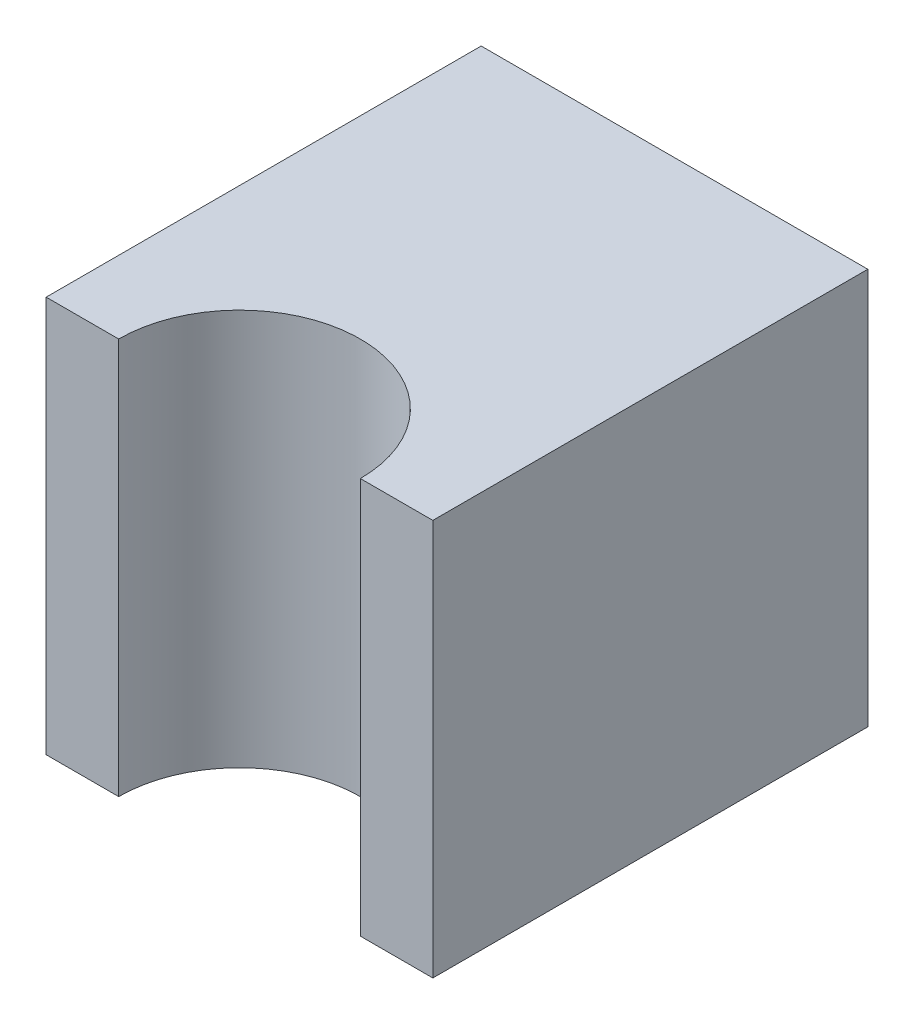
ISO-10303-21;
HEADER;
FILE_DESCRIPTION(('STEP AP214'),'2;1');
FILE_NAME('part.step','',(''),(''),'','','');
FILE_SCHEMA(('AUTOMOTIVE_DESIGN { 1 0 10303 214 1 1 1 1 }'));
ENDSEC;
DATA;
#1=APPLICATION_CONTEXT('core data for automotive mechanical design processes');
#2=APPLICATION_PROTOCOL_DEFINITION('international standard','automotive_design',2000,#1);
#3=PRODUCT_CONTEXT('',#1,'mechanical');
#4=PRODUCT('Part','Part','',(#3));
#5=PRODUCT_RELATED_PRODUCT_CATEGORY('part','',(#4));
#6=PRODUCT_DEFINITION_FORMATION('','',#4);
#7=PRODUCT_DEFINITION_CONTEXT('part definition',#1,'design');
#8=PRODUCT_DEFINITION('design','',#6,#7);
#9=PRODUCT_DEFINITION_SHAPE('','',#8);
#10=(LENGTH_UNIT() NAMED_UNIT(*) SI_UNIT(.MILLI.,.METRE.));
#11=(NAMED_UNIT(*) PLANE_ANGLE_UNIT() SI_UNIT($,.RADIAN.));
#12=(NAMED_UNIT(*) SI_UNIT($,.STERADIAN.) SOLID_ANGLE_UNIT());
#13=UNCERTAINTY_MEASURE_WITH_UNIT(LENGTH_MEASURE(1.E-05),#10,'distance_accuracy_value','');
#14=(GEOMETRIC_REPRESENTATION_CONTEXT(3) GLOBAL_UNCERTAINTY_ASSIGNED_CONTEXT((#13)) GLOBAL_UNIT_ASSIGNED_CONTEXT((#10,
#11,#12)) REPRESENTATION_CONTEXT('',''));
#15=CARTESIAN_POINT('',(0.,0.,0.));
#16=DIRECTION('',(0.,0.,1.));
#17=DIRECTION('',(1.,0.,0.));
#18=AXIS2_PLACEMENT_3D('',#15,#16,#17);
#19=CARTESIAN_POINT('',(0.65,0.,6.1));
#20=DIRECTION('',(0.,0.,1.));
#21=DIRECTION('',(1.,0.,0.));
#22=AXIS2_PLACEMENT_3D('',#19,#20,#21);
#23=PLANE('',#22);
#24=DIRECTION('',(1.,0.,0.));
#25=VECTOR('',#24,1.);
#26=CARTESIAN_POINT('',(0.4,0.82,6.1));
#27=LINE('',#26,#25);
#28=CARTESIAN_POINT('',(0.65,0.82,6.1));
#29=VERTEX_POINT('',#28);
#30=CARTESIAN_POINT('',(0.8,0.82,6.1));
#31=VERTEX_POINT('',#30);
#32=EDGE_CURVE('E76',#29,#31,#27,.T.);
#33=ORIENTED_EDGE('',*,*,#32,.F.);
#34=DIRECTION('',(0.,1.,0.));
#35=VECTOR('',#34,1.);
#36=CARTESIAN_POINT('',(0.65,0.,6.1));
#37=LINE('',#36,#35);
#38=CARTESIAN_POINT('',(0.65,0.,6.1));
#39=VERTEX_POINT('',#38);
#40=EDGE_CURVE('E72',#29,#39,#37,.F.);
#41=ORIENTED_EDGE('',*,*,#40,.T.);
#42=DIRECTION('',(1.,0.,0.));
#43=VECTOR('',#42,1.);
#44=CARTESIAN_POINT('',(0.4,0.,6.1));
#45=LINE('',#44,#43);
#46=CARTESIAN_POINT('',(0.8,0.,6.1));
#47=VERTEX_POINT('',#46);
#48=EDGE_CURVE('E73',#39,#47,#45,.T.);
#49=ORIENTED_EDGE('',*,*,#48,.T.);
#50=DIRECTION('',(0.,1.,0.));
#51=VECTOR('',#50,1.);
#52=CARTESIAN_POINT('',(0.8,0.,6.1));
#53=LINE('',#52,#51);
#54=EDGE_CURVE('E80',#31,#47,#53,.F.);
#55=ORIENTED_EDGE('',*,*,#54,.F.);
#56=EDGE_LOOP('',(#33,#41,#49,#55));
#57=FACE_BOUND('',#56,.T.);
#58=ADVANCED_FACE('F17',(#57),#23,.T.);
#59=CARTESIAN_POINT('',(0.4,0.,6.1));
#60=DIRECTION('',(0.,1.,0.));
#61=DIRECTION('',(0.,0.,1.));
#62=AXIS2_PLACEMENT_3D('',#59,#60,#61);
#63=CYLINDRICAL_SURFACE('',#62,0.25);
#64=ORIENTED_EDGE('',*,*,#40,.F.);
#65=CARTESIAN_POINT('',(0.4,0.82,6.1));
#66=DIRECTION('',(0.,1.,0.));
#67=DIRECTION('',(0.,0.,1.));
#68=AXIS2_PLACEMENT_3D('',#65,#66,#67);
#69=CIRCLE('',#68,0.25);
#70=CARTESIAN_POINT('',(0.15,0.82,6.1));
#71=VERTEX_POINT('',#70);
#72=EDGE_CURVE('E129',#71,#29,#69,.F.);
#73=ORIENTED_EDGE('',*,*,#72,.F.);
#74=DIRECTION('',(0.,1.,0.));
#75=VECTOR('',#74,1.);
#76=CARTESIAN_POINT('',(0.15,0.,6.1));
#77=LINE('',#76,#75);
#78=CARTESIAN_POINT('',(0.15,0.,6.1));
#79=VERTEX_POINT('',#78);
#80=EDGE_CURVE('E83',#79,#71,#77,.T.);
#81=ORIENTED_EDGE('',*,*,#80,.F.);
#82=CARTESIAN_POINT('',(0.4,0.,6.1));
#83=DIRECTION('',(0.,1.,0.));
#84=DIRECTION('',(0.,0.,1.));
#85=AXIS2_PLACEMENT_3D('',#82,#83,#84);
#86=CIRCLE('',#85,0.25);
#87=EDGE_CURVE('E20',#79,#39,#86,.F.);
#88=ORIENTED_EDGE('',*,*,#87,.T.);
#89=EDGE_LOOP('',(#64,#73,#81,#88));
#90=FACE_BOUND('',#89,.T.);
#91=ADVANCED_FACE('F82',(#90),#63,.F.);
#92=CARTESIAN_POINT('',(0.8,0.,6.1));
#93=DIRECTION('',(1.,0.,0.));
#94=DIRECTION('',(0.,0.,-1.));
#95=AXIS2_PLACEMENT_3D('',#92,#93,#94);
#96=PLANE('',#95);
#97=DIRECTION('',(0.,0.,1.));
#98=VECTOR('',#97,1.);
#99=CARTESIAN_POINT('',(0.8,0.82,5.65));
#100=LINE('',#99,#98);
#101=CARTESIAN_POINT('',(0.8,0.82,5.2));
#102=VERTEX_POINT('',#101);
#103=EDGE_CURVE('E108',#31,#102,#100,.F.);
#104=ORIENTED_EDGE('',*,*,#103,.F.);
#105=ORIENTED_EDGE('',*,*,#54,.T.);
#106=DIRECTION('',(0.,0.,1.));
#107=VECTOR('',#106,1.);
#108=CARTESIAN_POINT('',(0.8,0.,5.65));
#109=LINE('',#108,#107);
#110=CARTESIAN_POINT('',(0.8,0.,5.2));
#111=VERTEX_POINT('',#110);
#112=EDGE_CURVE('E85',#47,#111,#109,.F.);
#113=ORIENTED_EDGE('',*,*,#112,.T.);
#114=DIRECTION('',(0.,1.,0.));
#115=VECTOR('',#114,1.);
#116=CARTESIAN_POINT('',(0.8,0.,5.2));
#117=LINE('',#116,#115);
#118=EDGE_CURVE('E120',#102,#111,#117,.F.);
#119=ORIENTED_EDGE('',*,*,#118,.F.);
#120=EDGE_LOOP('',(#104,#105,#113,#119));
#121=FACE_BOUND('',#120,.T.);
#122=ADVANCED_FACE('F144',(#121),#96,.T.);
#123=CARTESIAN_POINT('',(0.4,0.,5.65));
#124=DIRECTION('',(0.,1.,0.));
#125=DIRECTION('',(0.,0.,1.));
#126=AXIS2_PLACEMENT_3D('',#123,#124,#125);
#127=PLANE('',#126);
#128=ORIENTED_EDGE('',*,*,#87,.F.);
#129=DIRECTION('',(1.,0.,0.));
#130=VECTOR('',#129,1.);
#131=CARTESIAN_POINT('',(0.,0.,6.1));
#132=LINE('',#131,#130);
#133=CARTESIAN_POINT('',(0.,0.,6.1));
#134=VERTEX_POINT('',#133);
#135=EDGE_CURVE('E88',#134,#79,#132,.T.);
#136=ORIENTED_EDGE('',*,*,#135,.F.);
#137=DIRECTION('',(0.,0.,1.));
#138=VECTOR('',#137,1.);
#139=CARTESIAN_POINT('',(0.,0.,5.2));
#140=LINE('',#139,#138);
#141=CARTESIAN_POINT('',(0.,0.,5.2));
#142=VERTEX_POINT('',#141);
#143=EDGE_CURVE('E105',#142,#134,#140,.T.);
#144=ORIENTED_EDGE('',*,*,#143,.F.);
#145=DIRECTION('',(-1.,0.,0.));
#146=VECTOR('',#145,1.);
#147=CARTESIAN_POINT('',(0.8,0.,5.2));
#148=LINE('',#147,#146);
#149=EDGE_CURVE('E126',#111,#142,#148,.T.);
#150=ORIENTED_EDGE('',*,*,#149,.F.);
#151=ORIENTED_EDGE('',*,*,#112,.F.);
#152=ORIENTED_EDGE('',*,*,#48,.F.);
#153=EDGE_LOOP('',(#128,#136,#144,#150,#151,#152));
#154=FACE_BOUND('',#153,.T.);
#155=ADVANCED_FACE('F86',(#154),#127,.F.);
#156=CARTESIAN_POINT('',(0.,0.,6.1));
#157=DIRECTION('',(0.,0.,1.));
#158=DIRECTION('',(1.,0.,0.));
#159=AXIS2_PLACEMENT_3D('',#156,#157,#158);
#160=PLANE('',#159);
#161=DIRECTION('',(1.,0.,0.));
#162=VECTOR('',#161,1.);
#163=CARTESIAN_POINT('',(0.4,0.82,6.1));
#164=LINE('',#163,#162);
#165=CARTESIAN_POINT('',(0.,0.82,6.1));
#166=VERTEX_POINT('',#165);
#167=EDGE_CURVE('E110',#166,#71,#164,.T.);
#168=ORIENTED_EDGE('',*,*,#167,.F.);
#169=DIRECTION('',(0.,1.,0.));
#170=VECTOR('',#169,1.);
#171=CARTESIAN_POINT('',(0.,0.,6.1));
#172=LINE('',#171,#170);
#173=EDGE_CURVE('E100',#134,#166,#172,.T.);
#174=ORIENTED_EDGE('',*,*,#173,.F.);
#175=ORIENTED_EDGE('',*,*,#135,.T.);
#176=ORIENTED_EDGE('',*,*,#80,.T.);
#177=EDGE_LOOP('',(#168,#174,#175,#176));
#178=FACE_BOUND('',#177,.T.);
#179=ADVANCED_FACE('F151',(#178),#160,.T.);
#180=CARTESIAN_POINT('',(0.4,0.82,5.65));
#181=DIRECTION('',(0.,1.,0.));
#182=DIRECTION('',(0.,0.,1.));
#183=AXIS2_PLACEMENT_3D('',#180,#181,#182);
#184=PLANE('',#183);
#185=ORIENTED_EDGE('',*,*,#167,.T.);
#186=ORIENTED_EDGE('',*,*,#72,.T.);
#187=ORIENTED_EDGE('',*,*,#32,.T.);
#188=ORIENTED_EDGE('',*,*,#103,.T.);
#189=DIRECTION('',(-1.,0.,0.));
#190=VECTOR('',#189,1.);
#191=CARTESIAN_POINT('',(0.8,0.82,5.2));
#192=LINE('',#191,#190);
#193=CARTESIAN_POINT('',(0.,0.82,5.2));
#194=VERTEX_POINT('',#193);
#195=EDGE_CURVE('E35',#194,#102,#192,.F.);
#196=ORIENTED_EDGE('',*,*,#195,.F.);
#197=DIRECTION('',(0.,0.,1.));
#198=VECTOR('',#197,1.);
#199=CARTESIAN_POINT('',(0.,0.82,5.2));
#200=LINE('',#199,#198);
#201=EDGE_CURVE('E26',#166,#194,#200,.F.);
#202=ORIENTED_EDGE('',*,*,#201,.F.);
#203=EDGE_LOOP('',(#185,#186,#187,#188,#196,#202));
#204=FACE_BOUND('',#203,.T.);
#205=ADVANCED_FACE('F140',(#204),#184,.T.);
#206=CARTESIAN_POINT('',(0.8,0.,5.2));
#207=DIRECTION('',(0.,0.,-1.));
#208=DIRECTION('',(-1.,0.,0.));
#209=AXIS2_PLACEMENT_3D('',#206,#207,#208);
#210=PLANE('',#209);
#211=ORIENTED_EDGE('',*,*,#195,.T.);
#212=ORIENTED_EDGE('',*,*,#118,.T.);
#213=ORIENTED_EDGE('',*,*,#149,.T.);
#214=DIRECTION('',(0.,1.,0.));
#215=VECTOR('',#214,1.);
#216=CARTESIAN_POINT('',(0.,0.,5.2));
#217=LINE('',#216,#215);
#218=EDGE_CURVE('E11',#194,#142,#217,.F.);
#219=ORIENTED_EDGE('',*,*,#218,.F.);
#220=EDGE_LOOP('',(#211,#212,#213,#219));
#221=FACE_BOUND('',#220,.T.);
#222=ADVANCED_FACE('F146',(#221),#210,.T.);
#223=CARTESIAN_POINT('',(0.,0.,5.2));
#224=DIRECTION('',(-1.,0.,0.));
#225=DIRECTION('',(0.,0.,1.));
#226=AXIS2_PLACEMENT_3D('',#223,#224,#225);
#227=PLANE('',#226);
#228=ORIENTED_EDGE('',*,*,#201,.T.);
#229=ORIENTED_EDGE('',*,*,#218,.T.);
#230=ORIENTED_EDGE('',*,*,#143,.T.);
#231=ORIENTED_EDGE('',*,*,#173,.T.);
#232=EDGE_LOOP('',(#228,#229,#230,#231));
#233=FACE_BOUND('',#232,.T.);
#234=ADVANCED_FACE('F148',(#233),#227,.T.);
#235=CLOSED_SHELL('',(#58,#91,#122,#155,#179,#205,#222,#234));
#236=MANIFOLD_SOLID_BREP('B1',#235);
#237=ADVANCED_BREP_SHAPE_REPRESENTATION('',(#18,#236),#14);
#238=SHAPE_DEFINITION_REPRESENTATION(#9,#237);
ENDSEC;
END-ISO-10303-21;
